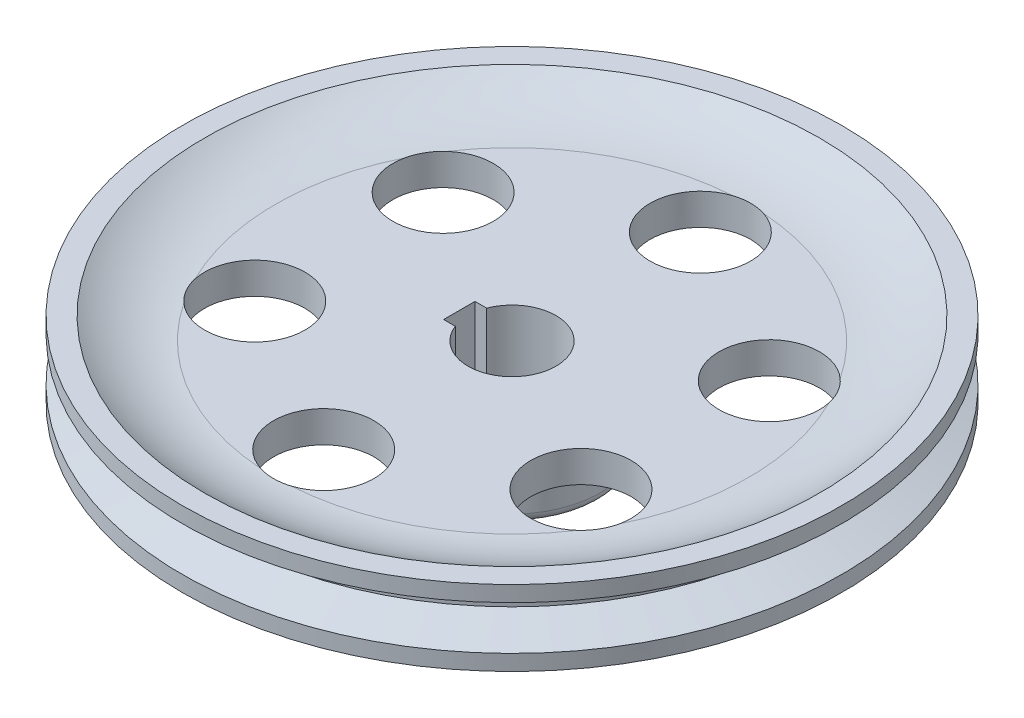
ISO-10303-21;
HEADER;
FILE_DESCRIPTION(('STEP AP214'),'2;1');
FILE_NAME('part.step','',(''),(''),'','','');
FILE_SCHEMA(('AUTOMOTIVE_DESIGN { 1 0 10303 214 1 1 1 1 }'));
ENDSEC;
DATA;
#1=APPLICATION_CONTEXT('core data for automotive mechanical design processes');
#2=APPLICATION_PROTOCOL_DEFINITION('international standard','automotive_design',2000,#1);
#3=PRODUCT_CONTEXT('',#1,'mechanical');
#4=PRODUCT('Part','Part','',(#3));
#5=PRODUCT_RELATED_PRODUCT_CATEGORY('part','',(#4));
#6=PRODUCT_DEFINITION_FORMATION('','',#4);
#7=PRODUCT_DEFINITION_CONTEXT('part definition',#1,'design');
#8=PRODUCT_DEFINITION('design','',#6,#7);
#9=PRODUCT_DEFINITION_SHAPE('','',#8);
#10=(LENGTH_UNIT() NAMED_UNIT(*) SI_UNIT(.MILLI.,.METRE.));
#11=(NAMED_UNIT(*) PLANE_ANGLE_UNIT() SI_UNIT($,.RADIAN.));
#12=(NAMED_UNIT(*) SI_UNIT($,.STERADIAN.) SOLID_ANGLE_UNIT());
#13=UNCERTAINTY_MEASURE_WITH_UNIT(LENGTH_MEASURE(1.E-05),#10,'distance_accuracy_value','');
#14=(GEOMETRIC_REPRESENTATION_CONTEXT(3) GLOBAL_UNCERTAINTY_ASSIGNED_CONTEXT((#13)) GLOBAL_UNIT_ASSIGNED_CONTEXT((#10,
#11,#12)) REPRESENTATION_CONTEXT('',''));
#15=CARTESIAN_POINT('',(0.,0.,0.));
#16=DIRECTION('',(0.,0.,1.));
#17=DIRECTION('',(1.,0.,0.));
#18=AXIS2_PLACEMENT_3D('',#15,#16,#17);
#19=CARTESIAN_POINT('',(-8.4,64.,2.5));
#20=DIRECTION('',(-1.,0.,0.));
#21=DIRECTION('',(0.,0.,1.));
#22=AXIS2_PLACEMENT_3D('',#19,#20,#21);
#23=PLANE('',#22);
#24=DIRECTION('',(0.,-1.,0.));
#25=VECTOR('',#24,1.);
#26=CARTESIAN_POINT('',(-8.4,64.,-2.5));
#27=LINE('',#26,#25);
#28=CARTESIAN_POINT('',(-8.4,2.5,-2.5));
#29=VERTEX_POINT('',#28);
#30=CARTESIAN_POINT('',(-8.4,-13.,-2.5));
#31=VERTEX_POINT('',#30);
#32=EDGE_CURVE('E229',#29,#31,#27,.T.);
#33=ORIENTED_EDGE('',*,*,#32,.F.);
#34=DIRECTION('',(0.,0.,-1.));
#35=VECTOR('',#34,1.);
#36=CARTESIAN_POINT('',(-8.4,2.5,2.5));
#37=LINE('',#36,#35);
#38=CARTESIAN_POINT('',(-8.4,2.5,2.5));
#39=VERTEX_POINT('',#38);
#40=EDGE_CURVE('E159',#39,#29,#37,.T.);
#41=ORIENTED_EDGE('',*,*,#40,.F.);
#42=DIRECTION('',(0.,-1.,0.));
#43=VECTOR('',#42,1.);
#44=CARTESIAN_POINT('',(-8.4,64.,2.5));
#45=LINE('',#44,#43);
#46=CARTESIAN_POINT('',(-8.4,-13.,2.5));
#47=VERTEX_POINT('',#46);
#48=EDGE_CURVE('E48',#39,#47,#45,.T.);
#49=ORIENTED_EDGE('',*,*,#48,.T.);
#50=DIRECTION('',(0.,0.,-1.));
#51=VECTOR('',#50,1.);
#52=CARTESIAN_POINT('',(-8.4,-13.,2.5));
#53=LINE('',#52,#51);
#54=EDGE_CURVE('E218',#47,#31,#53,.T.);
#55=ORIENTED_EDGE('',*,*,#54,.T.);
#56=EDGE_LOOP('',(#33,#41,#49,#55));
#57=FACE_BOUND('',#56,.T.);
#58=ADVANCED_FACE('F33',(#57),#23,.F.);
#59=CARTESIAN_POINT('',(-8.4,64.,-2.5));
#60=DIRECTION('',(0.,0.,-1.));
#61=DIRECTION('',(-1.,0.,0.));
#62=AXIS2_PLACEMENT_3D('',#59,#60,#61);
#63=PLANE('',#62);
#64=DIRECTION('',(0.,-1.,0.));
#65=VECTOR('',#64,1.);
#66=CARTESIAN_POINT('',(-6.53834841531101,64.,-2.5));
#67=LINE('',#66,#65);
#68=CARTESIAN_POINT('',(-6.53834841531101,2.5,-2.5));
#69=VERTEX_POINT('',#68);
#70=CARTESIAN_POINT('',(-6.53834841531101,-13.,-2.5));
#71=VERTEX_POINT('',#70);
#72=EDGE_CURVE('E227',#69,#71,#67,.T.);
#73=ORIENTED_EDGE('',*,*,#72,.F.);
#74=DIRECTION('',(1.,0.,0.));
#75=VECTOR('',#74,1.);
#76=CARTESIAN_POINT('',(-8.4,2.5,-2.5));
#77=LINE('',#76,#75);
#78=EDGE_CURVE('E161',#29,#69,#77,.T.);
#79=ORIENTED_EDGE('',*,*,#78,.F.);
#80=ORIENTED_EDGE('',*,*,#32,.T.);
#81=DIRECTION('',(1.,0.,0.));
#82=VECTOR('',#81,1.);
#83=CARTESIAN_POINT('',(-8.4,-13.,-2.5));
#84=LINE('',#83,#82);
#85=EDGE_CURVE('E220',#31,#71,#84,.T.);
#86=ORIENTED_EDGE('',*,*,#85,.T.);
#87=EDGE_LOOP('',(#73,#79,#80,#86));
#88=FACE_BOUND('',#87,.T.);
#89=ADVANCED_FACE('F252',(#88),#63,.F.);
#90=CARTESIAN_POINT('',(0.,64.,0.));
#91=DIRECTION('',(0.,-1.,0.));
#92=DIRECTION('',(0.,0.,-1.));
#93=AXIS2_PLACEMENT_3D('',#90,#91,#92);
#94=CYLINDRICAL_SURFACE('',#93,7.);
#95=DIRECTION('',(0.,-1.,0.));
#96=VECTOR('',#95,1.);
#97=CARTESIAN_POINT('',(-6.53834841531101,64.,2.5));
#98=LINE('',#97,#96);
#99=CARTESIAN_POINT('',(-6.53834841531101,2.5,2.5));
#100=VERTEX_POINT('',#99);
#101=CARTESIAN_POINT('',(-6.53834841531101,-13.,2.5));
#102=VERTEX_POINT('',#101);
#103=EDGE_CURVE('E55',#100,#102,#98,.T.);
#104=ORIENTED_EDGE('',*,*,#103,.F.);
#105=CARTESIAN_POINT('',(0.,2.5,0.));
#106=DIRECTION('',(0.,1.,0.));
#107=DIRECTION('',(0.,0.,1.));
#108=AXIS2_PLACEMENT_3D('',#105,#106,#107);
#109=CIRCLE('',#108,7.);
#110=EDGE_CURVE('E191',#69,#100,#109,.F.);
#111=ORIENTED_EDGE('',*,*,#110,.F.);
#112=ORIENTED_EDGE('',*,*,#72,.T.);
#113=CARTESIAN_POINT('',(0.,-13.,0.));
#114=DIRECTION('',(0.,-1.,0.));
#115=DIRECTION('',(0.,0.,-1.));
#116=AXIS2_PLACEMENT_3D('',#113,#114,#115);
#117=CIRCLE('',#116,7.);
#118=EDGE_CURVE('E223',#71,#102,#117,.T.);
#119=ORIENTED_EDGE('',*,*,#118,.T.);
#120=EDGE_LOOP('',(#104,#111,#112,#119));
#121=FACE_BOUND('',#120,.T.);
#122=ADVANCED_FACE('F257',(#121),#94,.F.);
#123=CARTESIAN_POINT('',(-8.4,64.,2.5));
#124=DIRECTION('',(0.,0.,1.));
#125=DIRECTION('',(1.,0.,0.));
#126=AXIS2_PLACEMENT_3D('',#123,#124,#125);
#127=PLANE('',#126);
#128=ORIENTED_EDGE('',*,*,#48,.F.);
#129=DIRECTION('',(-1.,0.,0.));
#130=VECTOR('',#129,1.);
#131=CARTESIAN_POINT('',(-8.4,2.5,2.5));
#132=LINE('',#131,#130);
#133=EDGE_CURVE('E158',#100,#39,#132,.T.);
#134=ORIENTED_EDGE('',*,*,#133,.F.);
#135=ORIENTED_EDGE('',*,*,#103,.T.);
#136=DIRECTION('',(-1.,0.,0.));
#137=VECTOR('',#136,1.);
#138=CARTESIAN_POINT('',(-8.4,-13.,2.5));
#139=LINE('',#138,#137);
#140=EDGE_CURVE('E214',#102,#47,#139,.T.);
#141=ORIENTED_EDGE('',*,*,#140,.T.);
#142=EDGE_LOOP('',(#128,#134,#135,#141));
#143=FACE_BOUND('',#142,.T.);
#144=ADVANCED_FACE('F262',(#143),#127,.F.);
#145=CARTESIAN_POINT('',(0.,-13.,0.));
#146=DIRECTION('',(0.,-1.,0.));
#147=DIRECTION('',(0.,0.,-1.));
#148=AXIS2_PLACEMENT_3D('',#145,#146,#147);
#149=PLANE('',#148);
#150=CARTESIAN_POINT('',(0.,-13.,0.));
#151=DIRECTION('',(0.,-1.,0.));
#152=DIRECTION('',(0.,0.,-1.));
#153=AXIS2_PLACEMENT_3D('',#150,#151,#152);
#154=CIRCLE('',#153,12.5);
#155=CARTESIAN_POINT('',(0.,-13.,-12.5));
#156=VERTEX_POINT('',#155);
#157=EDGE_CURVE('E226',#156,#156,#154,.T.);
#158=ORIENTED_EDGE('',*,*,#157,.T.);
#159=EDGE_LOOP('',(#158));
#160=FACE_BOUND('',#159,.T.);
#161=ORIENTED_EDGE('',*,*,#140,.F.);
#162=ORIENTED_EDGE('',*,*,#118,.F.);
#163=ORIENTED_EDGE('',*,*,#85,.F.);
#164=ORIENTED_EDGE('',*,*,#54,.F.);
#165=EDGE_LOOP('',(#161,#162,#163,#164));
#166=FACE_BOUND('',#165,.T.);
#167=ADVANCED_FACE('F265',(#160,#166),#149,.T.);
#168=CARTESIAN_POINT('',(0.,-13.,0.));
#169=DIRECTION('',(0.,1.,0.));
#170=DIRECTION('',(0.,0.,1.));
#171=AXIS2_PLACEMENT_3D('',#168,#169,#170);
#172=CYLINDRICAL_SURFACE('',#171,14.);
#173=CARTESIAN_POINT('',(0.,-4.5,0.));
#174=DIRECTION('',(0.,-1.,0.));
#175=DIRECTION('',(0.,0.,-1.));
#176=AXIS2_PLACEMENT_3D('',#173,#174,#175);
#177=CIRCLE('',#176,14.);
#178=CARTESIAN_POINT('',(0.,-4.5,-14.));
#179=VERTEX_POINT('',#178);
#180=EDGE_CURVE('E11',#179,#179,#177,.T.);
#181=ORIENTED_EDGE('',*,*,#180,.T.);
#182=EDGE_LOOP('',(#181));
#183=FACE_BOUND('',#182,.T.);
#184=CARTESIAN_POINT('',(0.,-11.5,0.));
#185=DIRECTION('',(0.,-1.,0.));
#186=DIRECTION('',(0.,0.,-1.));
#187=AXIS2_PLACEMENT_3D('',#184,#185,#186);
#188=CIRCLE('',#187,14.);
#189=CARTESIAN_POINT('',(0.,-11.5,-14.));
#190=VERTEX_POINT('',#189);
#191=EDGE_CURVE('E234',#190,#190,#188,.F.);
#192=ORIENTED_EDGE('',*,*,#191,.T.);
#193=EDGE_LOOP('',(#192));
#194=FACE_BOUND('',#193,.T.);
#195=ADVANCED_FACE('F268',(#183,#194),#172,.T.);
#196=CARTESIAN_POINT('',(0.,6.,0.));
#197=DIRECTION('',(0.,-1.,0.));
#198=DIRECTION('',(0.,0.,-1.));
#199=AXIS2_PLACEMENT_3D('',#196,#197,#198);
#200=CYLINDRICAL_SURFACE('',#199,52.5);
#201=CARTESIAN_POINT('',(0.,3.5,0.));
#202=DIRECTION('',(0.,-1.,0.));
#203=DIRECTION('',(0.,0.,-1.));
#204=AXIS2_PLACEMENT_3D('',#201,#202,#203);
#205=CIRCLE('',#204,52.5);
#206=CARTESIAN_POINT('',(0.,3.5,-52.5));
#207=VERTEX_POINT('',#206);
#208=EDGE_CURVE('E170',#207,#207,#205,.T.);
#209=ORIENTED_EDGE('',*,*,#208,.F.);
#210=EDGE_LOOP('',(#209));
#211=FACE_BOUND('',#210,.T.);
#212=CARTESIAN_POINT('',(0.,6.,0.));
#213=DIRECTION('',(0.,1.,0.));
#214=DIRECTION('',(0.,0.,1.));
#215=AXIS2_PLACEMENT_3D('',#212,#213,#214);
#216=CIRCLE('',#215,52.5);
#217=CARTESIAN_POINT('',(0.,6.,52.5));
#218=VERTEX_POINT('',#217);
#219=EDGE_CURVE('E163',#218,#218,#216,.T.);
#220=ORIENTED_EDGE('',*,*,#219,.F.);
#221=EDGE_LOOP('',(#220));
#222=FACE_BOUND('',#221,.T.);
#223=ADVANCED_FACE('F271',(#211,#222),#200,.T.);
#224=CARTESIAN_POINT('',(0.,6.,-30.));
#225=DIRECTION('',(0.,-1.,0.));
#226=DIRECTION('',(0.,0.,-1.));
#227=AXIS2_PLACEMENT_3D('',#224,#225,#226);
#228=CYLINDRICAL_SURFACE('',#227,8.);
#229=CARTESIAN_POINT('',(0.,2.5,-30.));
#230=DIRECTION('',(0.,1.,0.));
#231=DIRECTION('',(0.,0.,1.));
#232=AXIS2_PLACEMENT_3D('',#229,#230,#231);
#233=CIRCLE('',#232,8.);
#234=CARTESIAN_POINT('',(-2.44204296120639,2.5,-37.6181642260864));
#235=VERTEX_POINT('',#234);
#236=CARTESIAN_POINT('',(2.44204296120639,2.5,-37.6181642260864));
#237=VERTEX_POINT('',#236);
#238=EDGE_CURVE('E166',#235,#237,#233,.T.);
#239=ORIENTED_EDGE('',*,*,#238,.T.);
#240=CARTESIAN_POINT('',(2.44204296120639,2.5,-37.6181642260864));
#241=CARTESIAN_POINT('',(2.22511491145924,2.50001804574312,-37.6877291634036));
#242=CARTESIAN_POINT('',(2.00520103132929,2.50023054522728,-37.7479791155338));
#243=CARTESIAN_POINT('',(1.56102780970335,2.50079821075837,-37.8495210637499));
#244=CARTESIAN_POINT('',(1.33676826359948,2.50115338353843,-37.890812164921));
#245=CARTESIAN_POINT('',(0.891285679988767,2.5017523950846,-37.9532973839673));
#246=CARTESIAN_POINT('',(0.670130365995922,2.50199883446083,-37.9749756865466));
#247=CARTESIAN_POINT('',(0.226809508469231,2.50228568878189,-37.9998638703362));
#248=CARTESIAN_POINT('',(0.00464414024328063,2.50232613820794,-38.0030768425202));
#249=CARTESIAN_POINT('',(-0.403841935230448,2.50219519456786,-37.9919812757038));
#250=CARTESIAN_POINT('',(-0.59024136302794,2.50205648480942,-37.9803793331734));
#251=CARTESIAN_POINT('',(-0.961773046762758,2.50166630281131,-37.9441693659865));
#252=CARTESIAN_POINT('',(-1.146905339779,2.50141483388566,-37.9195617235655));
#253=CARTESIAN_POINT('',(-1.51902567999931,2.50088066764301,-37.8567758722984));
#254=CARTESIAN_POINT('',(-1.705965602652,2.50059740711445,-37.8183123215326));
#255=CARTESIAN_POINT('',(-2.07664803434037,2.50016144358059,-37.7281288818127));
#256=CARTESIAN_POINT('',(-2.2603900864213,2.5000087590861,-37.6764071146874));
#257=CARTESIAN_POINT('',(-2.44204296120639,2.5,-37.6181642260864));
#258=B_SPLINE_CURVE_WITH_KNOTS('',3,(#240,#241,#242,#243,#244,#245,#246,#247,#248,#249,#250,
#251,#252,#253,#254,#255,#256,#257),.UNSPECIFIED.,.F.,.F.,(4,2,2,2,2,2,2,2,4),(0.,
0.683221048383328,1.36647434354031,2.03235931245959,2.69813281340866,3.2579715253323,
3.81779378460353,4.38987384742968,4.96203499647572),.UNSPECIFIED.);
#259=EDGE_CURVE('E169',#237,#235,#258,.T.);
#260=ORIENTED_EDGE('',*,*,#259,.T.);
#261=EDGE_LOOP('',(#239,#260));
#262=FACE_BOUND('',#261,.T.);
#263=CARTESIAN_POINT('',(0.,-2.5,-30.));
#264=DIRECTION('',(0.,-1.,0.));
#265=DIRECTION('',(0.,0.,-1.));
#266=AXIS2_PLACEMENT_3D('',#263,#264,#265);
#267=CIRCLE('',#266,8.);
#268=CARTESIAN_POINT('',(0.,-2.5,-38.));
#269=VERTEX_POINT('',#268);
#270=EDGE_CURVE('E175',#269,#269,#267,.T.);
#271=ORIENTED_EDGE('',*,*,#270,.T.);
#272=EDGE_LOOP('',(#271));
#273=FACE_BOUND('',#272,.T.);
#274=ADVANCED_FACE('F276',(#262,#273),#228,.F.);
#275=CARTESIAN_POINT('',(25.980762113534,6.,-15.0000000000015));
#276=DIRECTION('',(0.,-1.,0.));
#277=DIRECTION('',(0.,0.,-1.));
#278=AXIS2_PLACEMENT_3D('',#275,#276,#277);
#279=CYLINDRICAL_SURFACE('',#278,8.00000000000046);
#280=CARTESIAN_POINT('',(25.980762113534,2.5,-15.0000000000015));
#281=DIRECTION('',(0.,1.,0.));
#282=DIRECTION('',(0.,0.,1.));
#283=AXIS2_PLACEMENT_3D('',#280,#281,#282);
#284=CIRCLE('',#283,8.00000000000046);
#285=CARTESIAN_POINT('',(31.3572643829177,2.5,-20.9239533545882));
#286=VERTEX_POINT('',#285);
#287=CARTESIAN_POINT('',(33.7993073441319,2.5,-16.6942108714996));
#288=VERTEX_POINT('',#287);
#289=EDGE_CURVE('E171',#286,#288,#284,.T.);
#290=ORIENTED_EDGE('',*,*,#289,.T.);
#291=CARTESIAN_POINT('',(33.7993073441319,2.5,-16.6942108714996));
#292=CARTESIAN_POINT('',(33.7510883221879,2.50001804574311,-16.9168585420327));
#293=CARTESIAN_POINT('',(33.6933093712447,2.50023054522728,-17.1374345249352));
#294=CARTESIAN_POINT('',(33.559160667137,2.50079821075838,-17.5728707926523));
#295=CARTESIAN_POINT('',(33.4827900366497,2.50115338353844,-17.787730807205));
#296=CARTESIAN_POINT('',(33.3141625318999,2.50175239508462,-18.2047726510788));
#297=CARTESIAN_POINT('',(33.2223588356483,2.50199883446085,-18.4071379224683));
#298=CARTESIAN_POINT('',(33.0222522063011,2.50228568878192,-18.8035091390089));
#299=CARTESIAN_POINT('',(32.9139520377213,2.50232613820798,-18.9975164778258));
#300=CARTESIAN_POINT('',(32.7000999572517,2.5021951945679,-19.3457280128713));
#301=CARTESIAN_POINT('',(32.5968526663877,2.50205648480945,-19.5013536813308));
#302=CARTESIAN_POINT('',(32.379728073065,2.50166630281134,-19.8050045741647));
#303=CARTESIAN_POINT('',(32.2658510830923,2.50141483388568,-19.9530300217682));
#304=CARTESIAN_POINT('',(32.0254167707848,2.50088066764303,-20.2439027640323));
#305=CARTESIAN_POINT('',(31.8986363973747,2.50059740711446,-20.3865657106492));
#306=CARTESIAN_POINT('',(31.6351940317304,2.50016144358059,-20.6624943933698));
#307=CARTESIAN_POINT('',(31.4985306414297,2.5000087590861,-20.7957587946536));
#308=CARTESIAN_POINT('',(31.3572643829177,2.5,-20.9239533545882));
#309=B_SPLINE_CURVE_WITH_KNOTS('',3,(#291,#292,#293,#294,#295,#296,#297,#298,#299,#300,#301,
#302,#303,#304,#305,#306,#307,#308),.UNSPECIFIED.,.F.,.F.,(4,2,2,2,2,2,2,2,4),(0.,
0.683221048383396,1.36647434354044,2.03235931245973,2.69813281340881,3.25797152533631,
3.8177937846114,4.38987384744163,4.96203499649172),.UNSPECIFIED.);
#310=EDGE_CURVE('E174',#288,#286,#309,.T.);
#311=ORIENTED_EDGE('',*,*,#310,.T.);
#312=EDGE_LOOP('',(#290,#311));
#313=FACE_BOUND('',#312,.T.);
#314=CARTESIAN_POINT('',(25.980762113534,-2.5,-15.0000000000015));
#315=DIRECTION('',(0.,-1.,0.));
#316=DIRECTION('',(0.,0.,-1.));
#317=AXIS2_PLACEMENT_3D('',#314,#315,#316);
#318=CIRCLE('',#317,8.00000000000046);
#319=CARTESIAN_POINT('',(25.980762113534,-2.5,-23.0000000000019));
#320=VERTEX_POINT('',#319);
#321=EDGE_CURVE('E180',#320,#320,#318,.T.);
#322=ORIENTED_EDGE('',*,*,#321,.T.);
#323=EDGE_LOOP('',(#322));
#324=FACE_BOUND('',#323,.T.);
#325=ADVANCED_FACE('F350',(#313,#324),#279,.F.);
#326=CARTESIAN_POINT('',(25.9807621135357,6.,14.9999999999985));
#327=DIRECTION('',(0.,-1.,0.));
#328=DIRECTION('',(0.,0.,-1.));
#329=AXIS2_PLACEMENT_3D('',#326,#327,#328);
#330=CYLINDRICAL_SURFACE('',#329,8.00000000000215);
#331=CARTESIAN_POINT('',(25.9807621135357,2.5,14.9999999999985));
#332=DIRECTION('',(0.,1.,0.));
#333=DIRECTION('',(0.,0.,1.));
#334=AXIS2_PLACEMENT_3D('',#331,#332,#333);
#335=CIRCLE('',#334,8.00000000000215);
#336=CARTESIAN_POINT('',(33.7993073441369,2.5,16.6942108714895));
#337=VERTEX_POINT('',#336);
#338=CARTESIAN_POINT('',(31.3572643829163,2.5,20.9239533545904));
#339=VERTEX_POINT('',#338);
#340=EDGE_CURVE('E176',#337,#339,#335,.T.);
#341=ORIENTED_EDGE('',*,*,#340,.T.);
#342=CARTESIAN_POINT('',(31.3572643829163,2.5,20.9239533545904));
#343=CARTESIAN_POINT('',(31.5259734107195,2.50001804574312,20.7708706213748));
#344=CARTESIAN_POINT('',(31.6881083399064,2.50023054522728,20.6105445906028));
#345=CARTESIAN_POINT('',(31.998132857425,2.50079821075838,20.2766502711024));
#346=CARTESIAN_POINT('',(32.1460217730416,2.50115338353845,20.103081357721));
#347=CARTESIAN_POINT('',(32.4228768519029,2.50175239508463,19.7485247328942));
#348=CARTESIAN_POINT('',(32.5522284696442,2.50199883446087,19.5678377640843));
#349=CARTESIAN_POINT('',(32.7954426978241,2.50228568878194,19.1963547313338));
#350=CARTESIAN_POINT('',(32.9093078974704,2.502326138208,19.0055603647012));
#351=CARTESIAN_POINT('',(33.1039418924767,2.50219519456792,18.6462532628387));
#352=CARTESIAN_POINT('',(33.1870940294121,2.50205648480948,18.4790256518479));
#353=CARTESIAN_POINT('',(33.3415011198278,2.50166630281137,18.139164791825));
#354=CARTESIAN_POINT('',(33.4127564228731,2.50141483388571,17.9665317017994));
#355=CARTESIAN_POINT('',(33.5444424507894,2.50088066764304,17.6128731082655));
#356=CARTESIAN_POINT('',(33.6046020000335,2.50059740711447,17.4317466108814));
#357=CARTESIAN_POINT('',(33.7118420660807,2.50016144358059,17.0656344884377));
#358=CARTESIAN_POINT('',(33.7589207278624,2.5000087590861,16.880648320027));
#359=CARTESIAN_POINT('',(33.7993073441369,2.5,16.6942108714895));
#360=B_SPLINE_CURVE_WITH_KNOTS('',3,(#342,#343,#344,#345,#346,#347,#348,#349,#350,#351,#352,
#353,#354,#355,#356,#357,#358,#359),.UNSPECIFIED.,.F.,.F.,(4,2,2,2,2,2,2,2,4),(0.,
0.68322104838356,1.36647434354078,2.03235931246018,2.69813281340938,3.25797152534028,
3.81779378461876,4.38987384745257,4.96203499650624),.UNSPECIFIED.);
#361=EDGE_CURVE('E179',#339,#337,#360,.T.);
#362=ORIENTED_EDGE('',*,*,#361,.T.);
#363=EDGE_LOOP('',(#341,#362));
#364=FACE_BOUND('',#363,.T.);
#365=CARTESIAN_POINT('',(25.9807621135357,-2.5,14.9999999999985));
#366=DIRECTION('',(0.,-1.,0.));
#367=DIRECTION('',(0.,0.,-1.));
#368=AXIS2_PLACEMENT_3D('',#365,#366,#367);
#369=CIRCLE('',#368,8.00000000000215);
#370=CARTESIAN_POINT('',(25.9807621135357,-2.5,6.99999999999638));
#371=VERTEX_POINT('',#370);
#372=EDGE_CURVE('E185',#371,#371,#369,.T.);
#373=ORIENTED_EDGE('',*,*,#372,.T.);
#374=EDGE_LOOP('',(#373));
#375=FACE_BOUND('',#374,.T.);
#376=ADVANCED_FACE('F353',(#364,#375),#330,.F.);
#377=CARTESIAN_POINT('',(3.39958331045615E-12,6.,30.));
#378=DIRECTION('',(0.,-1.,0.));
#379=DIRECTION('',(0.,0.,-1.));
#380=AXIS2_PLACEMENT_3D('',#377,#378,#379);
#381=CYLINDRICAL_SURFACE('',#380,8.00000000000345);
#382=CARTESIAN_POINT('',(3.39958331045615E-12,2.5,30.));
#383=DIRECTION('',(0.,1.,0.));
#384=DIRECTION('',(0.,0.,1.));
#385=AXIS2_PLACEMENT_3D('',#382,#383,#384);
#386=CIRCLE('',#385,8.00000000000345);
#387=CARTESIAN_POINT('',(2.44204296122484,2.5,37.6181642260852));
#388=VERTEX_POINT('',#387);
#389=CARTESIAN_POINT('',(-2.44204296121631,2.5,37.6181642260857));
#390=VERTEX_POINT('',#389);
#391=EDGE_CURVE('E181',#388,#390,#386,.T.);
#392=ORIENTED_EDGE('',*,*,#391,.T.);
#393=CARTESIAN_POINT('',(-2.44204296121631,2.5,37.6181642260857));
#394=CARTESIAN_POINT('',(-2.22511491146916,2.50001804574312,37.6877291634033));
#395=CARTESIAN_POINT('',(-2.0052010313392,2.50023054522728,37.7479791155339));
#396=CARTESIAN_POINT('',(-1.5610278097132,2.50079821075838,37.8495210637508));
#397=CARTESIAN_POINT('',(-1.33676826360928,2.50115338353845,37.8908121649222));
#398=CARTESIAN_POINT('',(-0.89128567999848,2.50175239508463,37.9532973839693));
#399=CARTESIAN_POINT('',(-0.670130366005592,2.50199883446087,37.974975686549));
#400=CARTESIAN_POINT('',(-0.226809508478782,2.50228568878194,37.9998638703393));
#401=CARTESIAN_POINT('',(-0.00464414025275639,2.502326138208,38.0030768425237));
#402=CARTESIAN_POINT('',(0.403841935223388,2.50219519456792,37.9919812757079));
#403=CARTESIAN_POINT('',(0.590241363023212,2.50205648480947,37.9803793331775));
#404=CARTESIAN_POINT('',(0.961773046762673,2.50166630281136,37.9441693659905));
#405=CARTESIAN_POINT('',(1.14690533978122,2.5014148338857,37.9195617235692));
#406=CARTESIAN_POINT('',(1.51902568000622,2.50088066764304,37.8567758723012));
#407=CARTESIAN_POINT('',(1.70596560266129,2.50059740711447,37.8183123215349));
#408=CARTESIAN_POINT('',(2.07664803435432,2.50016144358059,37.7281288818135));
#409=CARTESIAN_POINT('',(2.26039008643752,2.5000087590861,37.6764071146873));
#410=CARTESIAN_POINT('',(2.44204296122483,2.5,37.6181642260852));
#411=B_SPLINE_CURVE_WITH_KNOTS('',3,(#393,#394,#395,#396,#397,#398,#399,#400,#401,#402,#403,
#404,#405,#406,#407,#408,#409,#410),.UNSPECIFIED.,.F.,.F.,(4,2,2,2,2,2,2,2,4),(0.,
0.683221048383672,1.36647434354099,2.03235931246051,2.69813281340982,3.25797152534041,
3.81779378461859,4.38987384745206,4.96203499650541),.UNSPECIFIED.);
#412=EDGE_CURVE('E184',#390,#388,#411,.T.);
#413=ORIENTED_EDGE('',*,*,#412,.T.);
#414=EDGE_LOOP('',(#392,#413));
#415=FACE_BOUND('',#414,.T.);
#416=CARTESIAN_POINT('',(3.39958331045615E-12,-2.5,30.));
#417=DIRECTION('',(0.,-1.,0.));
#418=DIRECTION('',(0.,0.,-1.));
#419=AXIS2_PLACEMENT_3D('',#416,#417,#418);
#420=CIRCLE('',#419,8.00000000000345);
#421=CARTESIAN_POINT('',(3.39958331045615E-12,-2.5,21.9999999999966));
#422=VERTEX_POINT('',#421);
#423=EDGE_CURVE('E187',#422,#422,#420,.T.);
#424=ORIENTED_EDGE('',*,*,#423,.T.);
#425=EDGE_LOOP('',(#424));
#426=FACE_BOUND('',#425,.T.);
#427=ADVANCED_FACE('F359',(#415,#426),#381,.F.);
#428=CARTESIAN_POINT('',(-25.9807621135306,6.,15.0000000000015));
#429=DIRECTION('',(0.,-1.,0.));
#430=DIRECTION('',(0.,0.,-1.));
#431=AXIS2_PLACEMENT_3D('',#428,#429,#430);
#432=CYLINDRICAL_SURFACE('',#431,8.00000000000315);
#433=CARTESIAN_POINT('',(-25.9807621135306,2.5,15.0000000000015));
#434=DIRECTION('',(0.,1.,0.));
#435=DIRECTION('',(0.,0.,1.));
#436=AXIS2_PLACEMENT_3D('',#433,#434,#435);
#437=CIRCLE('',#436,8.00000000000315);
#438=CARTESIAN_POINT('',(-31.3572643829168,2.5,20.9239533545896));
#439=VERTEX_POINT('',#438);
#440=CARTESIAN_POINT('',(-33.7993073441308,2.5,16.6942108715019));
#441=VERTEX_POINT('',#440);
#442=EDGE_CURVE('E186',#439,#441,#437,.T.);
#443=ORIENTED_EDGE('',*,*,#442,.T.);
#444=CARTESIAN_POINT('',(-33.7993073441308,2.5,16.6942108715019));
#445=CARTESIAN_POINT('',(-33.7510883221867,2.50001804574312,16.9168585420351));
#446=CARTESIAN_POINT('',(-33.6933093712434,2.50023054522728,17.1374345249377));
#447=CARTESIAN_POINT('',(-33.5591606671356,2.50079821075838,17.5728707926548));
#448=CARTESIAN_POINT('',(-33.4827900366482,2.50115338353844,17.7877308072076));
#449=CARTESIAN_POINT('',(-33.3141625318983,2.50175239508462,18.2047726510815));
#450=CARTESIAN_POINT('',(-33.2223588356466,2.50199883446085,18.407137922471));
#451=CARTESIAN_POINT('',(-33.0222522062993,2.50228568878191,18.8035091390117));
#452=CARTESIAN_POINT('',(-32.9139520377194,2.50232613820797,18.9975164778287));
#453=CARTESIAN_POINT('',(-32.7000999572497,2.50219519456789,19.3457280128741));
#454=CARTESIAN_POINT('',(-32.5968526663858,2.50205648480944,19.5013536813334));
#455=CARTESIAN_POINT('',(-32.3797280730632,2.50166630281133,19.8050045741671));
#456=CARTESIAN_POINT('',(-32.2658510830906,2.50141483388568,19.9530300217704));
#457=CARTESIAN_POINT('',(-32.0254167707833,2.50088066764303,20.2439027640343));
#458=CARTESIAN_POINT('',(-31.8986363973732,2.50059740711446,20.386565710651));
#459=CARTESIAN_POINT('',(-31.6351940317292,2.50016144358059,20.6624943933714));
#460=CARTESIAN_POINT('',(-31.4985306414286,2.5000087590861,20.7957587946551));
#461=CARTESIAN_POINT('',(-31.3572643829168,2.5,20.9239533545896));
#462=B_SPLINE_CURVE_WITH_KNOTS('',3,(#444,#445,#446,#447,#448,#449,#450,#451,#452,#453,#454,
#455,#456,#457,#458,#459,#460,#461),.UNSPECIFIED.,.F.,.F.,(4,2,2,2,2,2,2,2,4),(0.,
0.683221048383618,1.36647434354089,2.03235931246041,2.69813281340973,3.25797152533678,
3.81779378461142,4.38987384744116,4.96203499649078),.UNSPECIFIED.);
#463=EDGE_CURVE('E134',#441,#439,#462,.T.);
#464=ORIENTED_EDGE('',*,*,#463,.T.);
#465=EDGE_LOOP('',(#443,#464));
#466=FACE_BOUND('',#465,.T.);
#467=CARTESIAN_POINT('',(-25.9807621135306,-2.5,15.0000000000015));
#468=DIRECTION('',(0.,-1.,0.));
#469=DIRECTION('',(0.,0.,-1.));
#470=AXIS2_PLACEMENT_3D('',#467,#468,#469);
#471=CIRCLE('',#470,8.00000000000315);
#472=CARTESIAN_POINT('',(-25.9807621135306,-2.5,6.99999999999833));
#473=VERTEX_POINT('',#472);
#474=EDGE_CURVE('E130',#473,#473,#471,.T.);
#475=ORIENTED_EDGE('',*,*,#474,.T.);
#476=EDGE_LOOP('',(#475));
#477=FACE_BOUND('',#476,.T.);
#478=ADVANCED_FACE('F308',(#466,#477),#432,.F.);
#479=CARTESIAN_POINT('',(-25.9807621135323,6.,-14.9999999999985));
#480=DIRECTION('',(0.,-1.,0.));
#481=DIRECTION('',(0.,0.,-1.));
#482=AXIS2_PLACEMENT_3D('',#479,#480,#481);
#483=CYLINDRICAL_SURFACE('',#482,8.0000000000016);
#484=CARTESIAN_POINT('',(-25.9807621135323,2.5,-14.9999999999985));
#485=DIRECTION('',(0.,1.,0.));
#486=DIRECTION('',(0.,0.,1.));
#487=AXIS2_PLACEMENT_3D('',#484,#485,#486);
#488=CIRCLE('',#487,8.0000000000016);
#489=CARTESIAN_POINT('',(-33.7993073441298,2.5,-16.6942108715038));
#490=VERTEX_POINT('',#489);
#491=CARTESIAN_POINT('',(-31.3572643829227,2.5,-20.9239533545807));
#492=VERTEX_POINT('',#491);
#493=EDGE_CURVE('E115',#490,#492,#488,.T.);
#494=ORIENTED_EDGE('',*,*,#493,.T.);
#495=CARTESIAN_POINT('',(-31.3572643829227,2.5,-20.9239533545807));
#496=CARTESIAN_POINT('',(-31.5259734107257,2.50001804574311,-20.7708706213648));
#497=CARTESIAN_POINT('',(-31.6881083399123,2.50023054522728,-20.6105445905925));
#498=CARTESIAN_POINT('',(-31.9981328574302,2.50079821075837,-20.2766502710917));
#499=CARTESIAN_POINT('',(-32.1460217730466,2.50115338353843,-20.1030813577101));
#500=CARTESIAN_POINT('',(-32.4228768519072,2.5017523950846,-19.7485247328828));
#501=CARTESIAN_POINT('',(-32.5522284696482,2.50199883446083,-19.5678377640727));
#502=CARTESIAN_POINT('',(-32.7954426978275,2.50228568878189,-19.1963547313218));
#503=CARTESIAN_POINT('',(-32.9093078974735,2.50232613820795,-19.0055603646889));
#504=CARTESIAN_POINT('',(-33.103941892478,2.50219519456787,-18.6462532628282));
#505=CARTESIAN_POINT('',(-33.1870940294122,2.50205648480942,-18.4790256518393));
#506=CARTESIAN_POINT('',(-33.3415011198257,2.50166630281131,-18.1391647918206));
#507=CARTESIAN_POINT('',(-33.41275642287,2.50141483388566,-17.9665317017971));
#508=CARTESIAN_POINT('',(-33.5444424507846,2.50088066764301,-17.6128731082676));
#509=CARTESIAN_POINT('',(-33.6046020000281,2.50059740711445,-17.4317466108859));
#510=CARTESIAN_POINT('',(-33.7118420660742,2.50016144358059,-17.0656344884471));
#511=CARTESIAN_POINT('',(-33.7589207278556,2.5000087590861,-16.8806483200388));
#512=CARTESIAN_POINT('',(-33.7993073441298,2.5,-16.6942108715038));
#513=B_SPLINE_CURVE_WITH_KNOTS('',3,(#495,#496,#497,#498,#499,#500,#501,#502,#503,#504,#505,
#506,#507,#508,#509,#510,#511,#512),.UNSPECIFIED.,.F.,.F.,(4,2,2,2,2,2,2,2,4),(0.,
0.68322104838347,1.36647434354059,2.03235931246,2.6981328134092,3.25797152533312,
3.81779378460463,4.38987384743107,4.9620349964774),.UNSPECIFIED.);
#514=EDGE_CURVE('E111',#492,#490,#513,.T.);
#515=ORIENTED_EDGE('',*,*,#514,.T.);
#516=EDGE_LOOP('',(#494,#515));
#517=FACE_BOUND('',#516,.T.);
#518=CARTESIAN_POINT('',(-25.9807621135323,-2.5,-14.9999999999985));
#519=DIRECTION('',(0.,-1.,0.));
#520=DIRECTION('',(0.,0.,-1.));
#521=AXIS2_PLACEMENT_3D('',#518,#519,#520);
#522=CIRCLE('',#521,8.0000000000016);
#523=CARTESIAN_POINT('',(-25.9807621135323,-2.5,-23.0000000000001));
#524=VERTEX_POINT('',#523);
#525=EDGE_CURVE('E119',#524,#524,#522,.T.);
#526=ORIENTED_EDGE('',*,*,#525,.T.);
#527=EDGE_LOOP('',(#526));
#528=FACE_BOUND('',#527,.T.);
#529=ADVANCED_FACE('F113',(#517,#528),#483,.F.);
#530=CARTESIAN_POINT('',(0.,6.,0.));
#531=DIRECTION('',(0.,1.,0.));
#532=DIRECTION('',(0.,0.,1.));
#533=AXIS2_PLACEMENT_3D('',#530,#531,#532);
#534=PLANE('',#533);
#535=CARTESIAN_POINT('',(0.,6.,0.));
#536=DIRECTION('',(0.,1.,0.));
#537=DIRECTION('',(0.,0.,1.));
#538=AXIS2_PLACEMENT_3D('',#535,#536,#537);
#539=CIRCLE('',#538,49.);
#540=CARTESIAN_POINT('',(0.,6.,49.));
#541=VERTEX_POINT('',#540);
#542=EDGE_CURVE('E194',#541,#541,#539,.T.);
#543=ORIENTED_EDGE('',*,*,#542,.F.);
#544=EDGE_LOOP('',(#543));
#545=FACE_BOUND('',#544,.T.);
#546=ORIENTED_EDGE('',*,*,#219,.T.);
#547=EDGE_LOOP('',(#546));
#548=FACE_BOUND('',#547,.T.);
#549=ADVANCED_FACE('F307',(#545,#548),#534,.T.);
#550=CARTESIAN_POINT('',(0.,-6.,0.));
#551=DIRECTION('',(0.,1.,0.));
#552=DIRECTION('',(0.,0.,1.));
#553=AXIS2_PLACEMENT_3D('',#550,#551,#552);
#554=PLANE('',#553);
#555=CARTESIAN_POINT('',(0.,-6.,0.));
#556=DIRECTION('',(0.,1.,0.));
#557=DIRECTION('',(0.,0.,1.));
#558=AXIS2_PLACEMENT_3D('',#555,#556,#557);
#559=CIRCLE('',#558,49.);
#560=CARTESIAN_POINT('',(0.,-6.,49.));
#561=VERTEX_POINT('',#560);
#562=EDGE_CURVE('E141',#561,#561,#559,.T.);
#563=ORIENTED_EDGE('',*,*,#562,.T.);
#564=EDGE_LOOP('',(#563));
#565=FACE_BOUND('',#564,.T.);
#566=CARTESIAN_POINT('',(0.,-6.,0.));
#567=DIRECTION('',(0.,1.,0.));
#568=DIRECTION('',(0.,0.,1.));
#569=AXIS2_PLACEMENT_3D('',#566,#567,#568);
#570=CIRCLE('',#569,52.5);
#571=CARTESIAN_POINT('',(0.,-6.,52.5));
#572=VERTEX_POINT('',#571);
#573=EDGE_CURVE('E136',#572,#572,#570,.T.);
#574=ORIENTED_EDGE('',*,*,#573,.F.);
#575=EDGE_LOOP('',(#574));
#576=FACE_BOUND('',#575,.T.);
#577=ADVANCED_FACE('F382',(#565,#576),#554,.F.);
#578=CARTESIAN_POINT('',(0.,-3.5,0.));
#579=DIRECTION('',(0.,-1.,0.));
#580=DIRECTION('',(0.,0.,-1.));
#581=AXIS2_PLACEMENT_3D('',#578,#579,#580);
#582=CIRCLE('',#581,52.5);
#583=CARTESIAN_POINT('',(0.,-3.5,-52.5));
#584=VERTEX_POINT('',#583);
#585=EDGE_CURVE('E393',#584,#584,#582,.T.);
#586=ORIENTED_EDGE('',*,*,#585,.T.);
#587=EDGE_LOOP('',(#586));
#588=FACE_BOUND('',#587,.T.);
#589=ORIENTED_EDGE('',*,*,#573,.T.);
#590=EDGE_LOOP('',(#589));
#591=FACE_BOUND('',#590,.T.);
#592=ADVANCED_FACE('F279',(#588,#591),#200,.T.);
#593=CARTESIAN_POINT('',(0.,2.5,0.));
#594=DIRECTION('',(0.,1.,0.));
#595=DIRECTION('',(0.,0.,1.));
#596=AXIS2_PLACEMENT_3D('',#593,#594,#595);
#597=PLANE('',#596);
#598=ORIENTED_EDGE('',*,*,#493,.F.);
#599=CARTESIAN_POINT('',(0.,2.5,0.));
#600=DIRECTION('',(0.,1.,0.));
#601=DIRECTION('',(0.,0.,1.));
#602=AXIS2_PLACEMENT_3D('',#599,#600,#601);
#603=CIRCLE('',#602,37.6973454445427);
#604=EDGE_CURVE('E126',#490,#441,#603,.T.);
#605=ORIENTED_EDGE('',*,*,#604,.T.);
#606=ORIENTED_EDGE('',*,*,#442,.F.);
#607=CARTESIAN_POINT('',(0.,2.5,0.));
#608=DIRECTION('',(0.,1.,0.));
#609=DIRECTION('',(0.,0.,1.));
#610=AXIS2_PLACEMENT_3D('',#607,#608,#609);
#611=CIRCLE('',#610,37.6973454445427);
#612=EDGE_CURVE('E135',#439,#390,#611,.T.);
#613=ORIENTED_EDGE('',*,*,#612,.T.);
#614=ORIENTED_EDGE('',*,*,#391,.F.);
#615=CARTESIAN_POINT('',(0.,2.5,0.));
#616=DIRECTION('',(0.,1.,0.));
#617=DIRECTION('',(0.,0.,1.));
#618=AXIS2_PLACEMENT_3D('',#615,#616,#617);
#619=CIRCLE('',#618,37.6973454445427);
#620=EDGE_CURVE('E138',#388,#339,#619,.T.);
#621=ORIENTED_EDGE('',*,*,#620,.T.);
#622=ORIENTED_EDGE('',*,*,#340,.F.);
#623=CARTESIAN_POINT('',(0.,2.5,0.));
#624=DIRECTION('',(0.,1.,0.));
#625=DIRECTION('',(0.,0.,1.));
#626=AXIS2_PLACEMENT_3D('',#623,#624,#625);
#627=CIRCLE('',#626,37.6973454445427);
#628=EDGE_CURVE('E153',#337,#288,#627,.T.);
#629=ORIENTED_EDGE('',*,*,#628,.T.);
#630=ORIENTED_EDGE('',*,*,#289,.F.);
#631=CARTESIAN_POINT('',(0.,2.5,0.));
#632=DIRECTION('',(0.,1.,0.));
#633=DIRECTION('',(0.,0.,1.));
#634=AXIS2_PLACEMENT_3D('',#631,#632,#633);
#635=CIRCLE('',#634,37.6973454445427);
#636=EDGE_CURVE('E155',#286,#237,#635,.T.);
#637=ORIENTED_EDGE('',*,*,#636,.T.);
#638=ORIENTED_EDGE('',*,*,#238,.F.);
#639=CARTESIAN_POINT('',(0.,2.5,0.));
#640=DIRECTION('',(0.,1.,0.));
#641=DIRECTION('',(0.,0.,1.));
#642=AXIS2_PLACEMENT_3D('',#639,#640,#641);
#643=CIRCLE('',#642,37.6973454445427);
#644=EDGE_CURVE('E129',#235,#492,#643,.T.);
#645=ORIENTED_EDGE('',*,*,#644,.T.);
#646=EDGE_LOOP('',(#598,#605,#606,#613,#614,#621,#622,#629,#630,#637,#638,#645));
#647=FACE_BOUND('',#646,.T.);
#648=ORIENTED_EDGE('',*,*,#133,.T.);
#649=ORIENTED_EDGE('',*,*,#40,.T.);
#650=ORIENTED_EDGE('',*,*,#78,.T.);
#651=ORIENTED_EDGE('',*,*,#110,.T.);
#652=EDGE_LOOP('',(#648,#649,#650,#651));
#653=FACE_BOUND('',#652,.T.);
#654=ADVANCED_FACE('F123',(#647,#653),#597,.T.);
#655=CARTESIAN_POINT('',(0.,22.5,0.));
#656=DIRECTION('',(0.,-1.,0.));
#657=DIRECTION('',(0.,0.,-1.));
#658=AXIS2_PLACEMENT_3D('',#655,#656,#657);
#659=TOROIDAL_SURFACE('',#658,37.6973454445427,20.);
#660=ORIENTED_EDGE('',*,*,#542,.T.);
#661=EDGE_LOOP('',(#660));
#662=FACE_BOUND('',#661,.T.);
#663=ORIENTED_EDGE('',*,*,#463,.F.);
#664=ORIENTED_EDGE('',*,*,#604,.F.);
#665=ORIENTED_EDGE('',*,*,#514,.F.);
#666=ORIENTED_EDGE('',*,*,#644,.F.);
#667=ORIENTED_EDGE('',*,*,#259,.F.);
#668=ORIENTED_EDGE('',*,*,#636,.F.);
#669=ORIENTED_EDGE('',*,*,#310,.F.);
#670=ORIENTED_EDGE('',*,*,#628,.F.);
#671=ORIENTED_EDGE('',*,*,#361,.F.);
#672=ORIENTED_EDGE('',*,*,#620,.F.);
#673=ORIENTED_EDGE('',*,*,#412,.F.);
#674=ORIENTED_EDGE('',*,*,#612,.F.);
#675=EDGE_LOOP('',(#663,#664,#665,#666,#667,#668,#669,#670,#671,#672,#673,#674));
#676=FACE_BOUND('',#675,.T.);
#677=ADVANCED_FACE('F132',(#662,#676),#659,.F.);
#678=CARTESIAN_POINT('',(0.,-2.5,0.));
#679=DIRECTION('',(0.,-1.,0.));
#680=DIRECTION('',(0.,0.,1.));
#681=AXIS2_PLACEMENT_3D('',#678,#679,#680);
#682=PLANE('',#681);
#683=CARTESIAN_POINT('',(0.,-2.5,0.));
#684=DIRECTION('',(0.,-1.,0.));
#685=DIRECTION('',(0.,0.,-1.));
#686=AXIS2_PLACEMENT_3D('',#683,#684,#685);
#687=CIRCLE('',#686,16.);
#688=CARTESIAN_POINT('',(0.,-2.5,-16.));
#689=VERTEX_POINT('',#688);
#690=EDGE_CURVE('E41',#689,#689,#687,.F.);
#691=ORIENTED_EDGE('',*,*,#690,.T.);
#692=EDGE_LOOP('',(#691));
#693=FACE_BOUND('',#692,.T.);
#694=ORIENTED_EDGE('',*,*,#270,.F.);
#695=EDGE_LOOP('',(#694));
#696=FACE_BOUND('',#695,.T.);
#697=ORIENTED_EDGE('',*,*,#321,.F.);
#698=EDGE_LOOP('',(#697));
#699=FACE_BOUND('',#698,.T.);
#700=ORIENTED_EDGE('',*,*,#372,.F.);
#701=EDGE_LOOP('',(#700));
#702=FACE_BOUND('',#701,.T.);
#703=ORIENTED_EDGE('',*,*,#423,.F.);
#704=EDGE_LOOP('',(#703));
#705=FACE_BOUND('',#704,.T.);
#706=ORIENTED_EDGE('',*,*,#474,.F.);
#707=EDGE_LOOP('',(#706));
#708=FACE_BOUND('',#707,.T.);
#709=ORIENTED_EDGE('',*,*,#525,.F.);
#710=EDGE_LOOP('',(#709));
#711=FACE_BOUND('',#710,.T.);
#712=CARTESIAN_POINT('',(0.,-2.5,0.));
#713=DIRECTION('',(0.,-1.,0.));
#714=DIRECTION('',(0.,0.,-1.));
#715=AXIS2_PLACEMENT_3D('',#712,#713,#714);
#716=CIRCLE('',#715,46.0631512908795);
#717=CARTESIAN_POINT('',(0.,-2.5,-46.0631512908795));
#718=VERTEX_POINT('',#717);
#719=EDGE_CURVE('E199',#718,#718,#716,.F.);
#720=ORIENTED_EDGE('',*,*,#719,.F.);
#721=EDGE_LOOP('',(#720));
#722=FACE_BOUND('',#721,.T.);
#723=ADVANCED_FACE('F239',(#693,#696,#699,#702,#705,#708,#711,#722),#682,.T.);
#724=CARTESIAN_POINT('',(0.,-6.,0.));
#725=DIRECTION('',(0.,-1.,0.));
#726=DIRECTION('',(0.,0.,1.));
#727=AXIS2_PLACEMENT_3D('',#724,#725,#726);
#728=CONICAL_SURFACE('',#727,49.,0.698131700797733);
#729=ORIENTED_EDGE('',*,*,#719,.T.);
#730=EDGE_LOOP('',(#729));
#731=FACE_BOUND('',#730,.T.);
#732=ORIENTED_EDGE('',*,*,#562,.F.);
#733=EDGE_LOOP('',(#732));
#734=FACE_BOUND('',#733,.T.);
#735=ADVANCED_FACE('F298',(#731,#734),#728,.F.);
#736=CARTESIAN_POINT('',(0.,3.5,0.));
#737=DIRECTION('',(0.,1.,0.));
#738=DIRECTION('',(0.,0.,1.));
#739=AXIS2_PLACEMENT_3D('',#736,#737,#738);
#740=CONICAL_SURFACE('',#739,52.5,1.22173047639603);
#741=CARTESIAN_POINT('',(0.,1.31617859440279,0.));
#742=DIRECTION('',(0.,-1.,0.));
#743=DIRECTION('',(0.,0.,-1.));
#744=AXIS2_PLACEMENT_3D('',#741,#742,#743);
#745=CIRCLE('',#744,46.5);
#746=CARTESIAN_POINT('',(0.,1.31617859440279,-46.5));
#747=VERTEX_POINT('',#746);
#748=EDGE_CURVE('E398',#747,#747,#745,.T.);
#749=ORIENTED_EDGE('',*,*,#748,.F.);
#750=EDGE_LOOP('',(#749));
#751=FACE_BOUND('',#750,.T.);
#752=ORIENTED_EDGE('',*,*,#208,.T.);
#753=EDGE_LOOP('',(#752));
#754=FACE_BOUND('',#753,.T.);
#755=ADVANCED_FACE('F301',(#751,#754),#740,.T.);
#756=CARTESIAN_POINT('',(0.,-1.31617859440282,0.));
#757=DIRECTION('',(0.,-1.,0.));
#758=DIRECTION('',(0.,0.,-1.));
#759=AXIS2_PLACEMENT_3D('',#756,#757,#758);
#760=CONICAL_SURFACE('',#759,46.5,1.22173047639604);
#761=ORIENTED_EDGE('',*,*,#585,.F.);
#762=EDGE_LOOP('',(#761));
#763=FACE_BOUND('',#762,.T.);
#764=CARTESIAN_POINT('',(0.,-1.31617859440282,0.));
#765=DIRECTION('',(0.,-1.,0.));
#766=DIRECTION('',(0.,0.,-1.));
#767=AXIS2_PLACEMENT_3D('',#764,#765,#766);
#768=CIRCLE('',#767,46.5);
#769=CARTESIAN_POINT('',(0.,-1.31617859440282,-46.5));
#770=VERTEX_POINT('',#769);
#771=EDGE_CURVE('E395',#770,#770,#768,.T.);
#772=ORIENTED_EDGE('',*,*,#771,.T.);
#773=EDGE_LOOP('',(#772));
#774=FACE_BOUND('',#773,.T.);
#775=ADVANCED_FACE('F407',(#763,#774),#760,.T.);
#776=CARTESIAN_POINT('',(0.,0.,0.));
#777=DIRECTION('',(0.,-1.,0.));
#778=DIRECTION('',(0.,0.,-1.));
#779=AXIS2_PLACEMENT_3D('',#776,#777,#778);
#780=CYLINDRICAL_SURFACE('',#779,46.5);
#781=ORIENTED_EDGE('',*,*,#771,.F.);
#782=EDGE_LOOP('',(#781));
#783=FACE_BOUND('',#782,.T.);
#784=ORIENTED_EDGE('',*,*,#748,.T.);
#785=EDGE_LOOP('',(#784));
#786=FACE_BOUND('',#785,.T.);
#787=ADVANCED_FACE('F248',(#783,#786),#780,.T.);
#788=CARTESIAN_POINT('',(0.,-11.5,0.));
#789=DIRECTION('',(0.,-1.,0.));
#790=DIRECTION('',(0.,0.,-1.));
#791=AXIS2_PLACEMENT_3D('',#788,#789,#790);
#792=TOROIDAL_SURFACE('',#791,12.5,1.5);
#793=ORIENTED_EDGE('',*,*,#191,.F.);
#794=EDGE_LOOP('',(#793));
#795=FACE_BOUND('',#794,.T.);
#796=ORIENTED_EDGE('',*,*,#157,.F.);
#797=EDGE_LOOP('',(#796));
#798=FACE_BOUND('',#797,.T.);
#799=ADVANCED_FACE('F243',(#795,#798),#792,.T.);
#800=CARTESIAN_POINT('',(0.,-4.5,0.));
#801=DIRECTION('',(0.,-1.,0.));
#802=DIRECTION('',(0.,0.,-1.));
#803=AXIS2_PLACEMENT_3D('',#800,#801,#802);
#804=TOROIDAL_SURFACE('',#803,16.,2.);
#805=ORIENTED_EDGE('',*,*,#180,.F.);
#806=EDGE_LOOP('',(#805));
#807=FACE_BOUND('',#806,.T.);
#808=ORIENTED_EDGE('',*,*,#690,.F.);
#809=EDGE_LOOP('',(#808));
#810=FACE_BOUND('',#809,.T.);
#811=ADVANCED_FACE('F35',(#807,#810),#804,.F.);
#812=CLOSED_SHELL('',(#58,#89,#122,#144,#167,#195,#223,#274,#325,#376,#427,#478,#529,#549,#577,
#592,#654,#677,#723,#735,#755,#775,#787,#799,#811));
#813=MANIFOLD_SOLID_BREP('B2',#812);
#814=ADVANCED_BREP_SHAPE_REPRESENTATION('',(#18,#813),#14);
#815=SHAPE_DEFINITION_REPRESENTATION(#9,#814);
ENDSEC;
END-ISO-10303-21;
